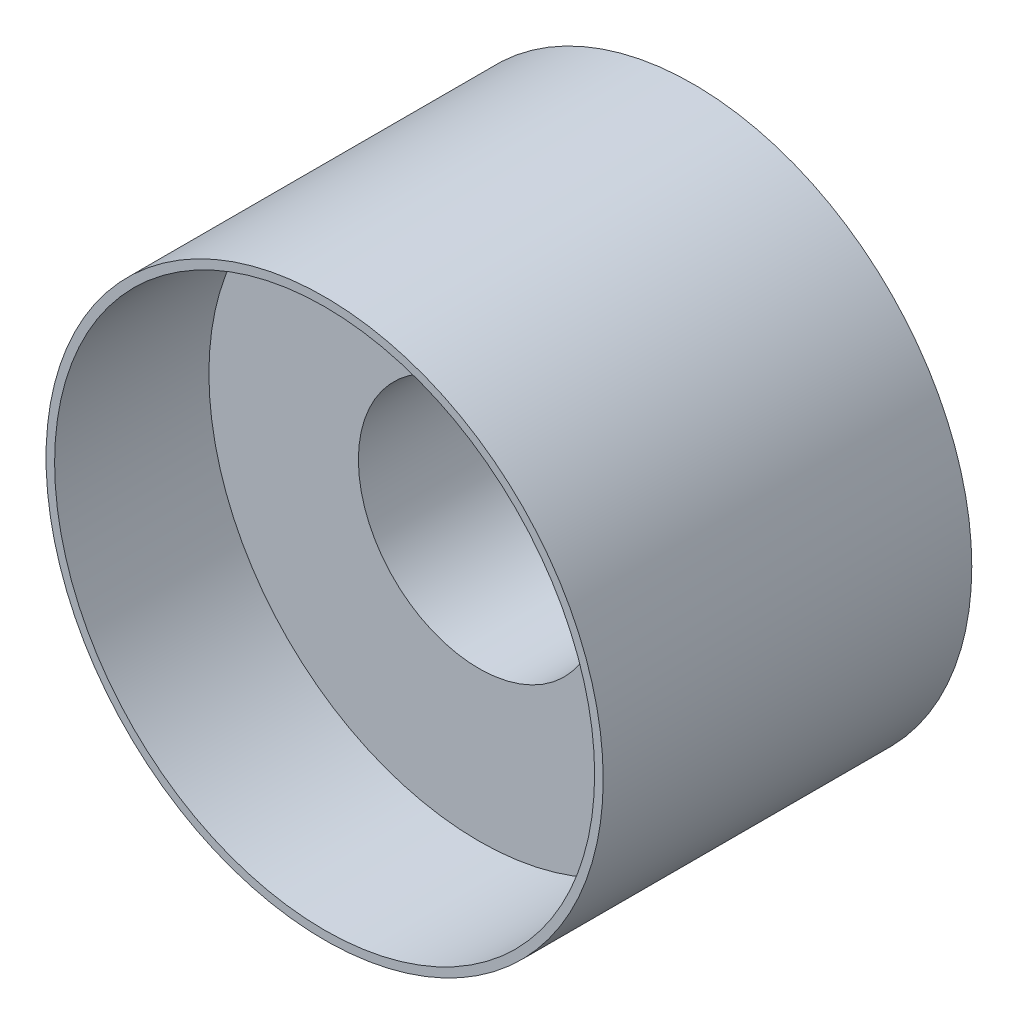
ISO-10303-21;
HEADER;
FILE_DESCRIPTION(('STEP AP214'),'2;1');
FILE_NAME('part.step','',(''),(''),'','','');
FILE_SCHEMA(('AUTOMOTIVE_DESIGN { 1 0 10303 214 1 1 1 1 }'));
ENDSEC;
DATA;
#1=APPLICATION_CONTEXT('core data for automotive mechanical design processes');
#2=APPLICATION_PROTOCOL_DEFINITION('international standard','automotive_design',2000,#1);
#3=PRODUCT_CONTEXT('',#1,'mechanical');
#4=PRODUCT('Part','Part','',(#3));
#5=PRODUCT_RELATED_PRODUCT_CATEGORY('part','',(#4));
#6=PRODUCT_DEFINITION_FORMATION('','',#4);
#7=PRODUCT_DEFINITION_CONTEXT('part definition',#1,'design');
#8=PRODUCT_DEFINITION('design','',#6,#7);
#9=PRODUCT_DEFINITION_SHAPE('','',#8);
#10=(LENGTH_UNIT() NAMED_UNIT(*) SI_UNIT(.MILLI.,.METRE.));
#11=(NAMED_UNIT(*) PLANE_ANGLE_UNIT() SI_UNIT($,.RADIAN.));
#12=(NAMED_UNIT(*) SI_UNIT($,.STERADIAN.) SOLID_ANGLE_UNIT());
#13=UNCERTAINTY_MEASURE_WITH_UNIT(LENGTH_MEASURE(1.E-05),#10,'distance_accuracy_value','');
#14=(GEOMETRIC_REPRESENTATION_CONTEXT(3) GLOBAL_UNCERTAINTY_ASSIGNED_CONTEXT((#13)) GLOBAL_UNIT_ASSIGNED_CONTEXT((#10,
#11,#12)) REPRESENTATION_CONTEXT('',''));
#15=CARTESIAN_POINT('',(0.,0.,0.));
#16=DIRECTION('',(0.,0.,1.));
#17=DIRECTION('',(1.,0.,0.));
#18=AXIS2_PLACEMENT_3D('',#15,#16,#17);
#19=CARTESIAN_POINT('',(0.,0.,-8.7376));
#20=DIRECTION('',(0.,0.,1.));
#21=DIRECTION('',(1.,0.,0.));
#22=AXIS2_PLACEMENT_3D('',#19,#20,#21);
#23=CYLINDRICAL_SURFACE('',#22,6.4008);
#24=CARTESIAN_POINT('',(0.,0.,0.));
#25=DIRECTION('',(0.,0.,1.));
#26=DIRECTION('',(1.,0.,0.));
#27=AXIS2_PLACEMENT_3D('',#24,#25,#26);
#28=CIRCLE('',#27,6.4008);
#29=CARTESIAN_POINT('',(6.4008,0.,0.));
#30=VERTEX_POINT('',#29);
#31=EDGE_CURVE('E49',#30,#30,#28,.T.);
#32=ORIENTED_EDGE('',*,*,#31,.T.);
#33=EDGE_LOOP('',(#32));
#34=FACE_BOUND('',#33,.T.);
#35=CARTESIAN_POINT('',(0.,0.,-3.6576));
#36=DIRECTION('',(0.,0.,-1.));
#37=DIRECTION('',(-1.,0.,0.));
#38=AXIS2_PLACEMENT_3D('',#35,#36,#37);
#39=CIRCLE('',#38,6.4008);
#40=CARTESIAN_POINT('',(-6.4008,0.,-3.6576));
#41=VERTEX_POINT('',#40);
#42=EDGE_CURVE('E10',#41,#41,#39,.F.);
#43=ORIENTED_EDGE('',*,*,#42,.F.);
#44=EDGE_LOOP('',(#43));
#45=FACE_BOUND('',#44,.T.);
#46=ADVANCED_FACE('F33',(#34,#45),#23,.F.);
#47=CARTESIAN_POINT('',(0.,0.,-8.7376));
#48=DIRECTION('',(0.,0.,1.));
#49=DIRECTION('',(1.,0.,0.));
#50=AXIS2_PLACEMENT_3D('',#47,#48,#49);
#51=CYLINDRICAL_SURFACE('',#50,6.604);
#52=CARTESIAN_POINT('',(0.,0.,-8.7376));
#53=DIRECTION('',(0.,0.,1.));
#54=DIRECTION('',(1.,0.,0.));
#55=AXIS2_PLACEMENT_3D('',#52,#53,#54);
#56=CIRCLE('',#55,6.604);
#57=CARTESIAN_POINT('',(6.604,0.,-8.7376));
#58=VERTEX_POINT('',#57);
#59=EDGE_CURVE('E40',#58,#58,#56,.T.);
#60=ORIENTED_EDGE('',*,*,#59,.T.);
#61=EDGE_LOOP('',(#60));
#62=FACE_BOUND('',#61,.T.);
#63=CARTESIAN_POINT('',(0.,0.,0.));
#64=DIRECTION('',(0.,0.,1.));
#65=DIRECTION('',(1.,0.,0.));
#66=AXIS2_PLACEMENT_3D('',#63,#64,#65);
#67=CIRCLE('',#66,6.604);
#68=CARTESIAN_POINT('',(6.604,0.,0.));
#69=VERTEX_POINT('',#68);
#70=EDGE_CURVE('E44',#69,#69,#67,.T.);
#71=ORIENTED_EDGE('',*,*,#70,.F.);
#72=EDGE_LOOP('',(#71));
#73=FACE_BOUND('',#72,.T.);
#74=ADVANCED_FACE('F35',(#62,#73),#51,.T.);
#75=CARTESIAN_POINT('',(0.,0.,-8.7376));
#76=DIRECTION('',(0.,0.,1.));
#77=DIRECTION('',(1.,0.,0.));
#78=AXIS2_PLACEMENT_3D('',#75,#76,#77);
#79=PLANE('',#78);
#80=ORIENTED_EDGE('',*,*,#59,.F.);
#81=EDGE_LOOP('',(#80));
#82=FACE_BOUND('',#81,.T.);
#83=CARTESIAN_POINT('',(0.,0.,-8.7376));
#84=DIRECTION('',(0.,0.,-1.));
#85=DIRECTION('',(-1.,0.,0.));
#86=AXIS2_PLACEMENT_3D('',#83,#84,#85);
#87=CIRCLE('',#86,2.8575);
#88=CARTESIAN_POINT('',(-2.8575,0.,-8.7376));
#89=VERTEX_POINT('',#88);
#90=EDGE_CURVE('E54',#89,#89,#87,.T.);
#91=ORIENTED_EDGE('',*,*,#90,.F.);
#92=EDGE_LOOP('',(#91));
#93=FACE_BOUND('',#92,.T.);
#94=ADVANCED_FACE('F68',(#82,#93),#79,.F.);
#95=CARTESIAN_POINT('',(0.,0.,0.));
#96=DIRECTION('',(0.,0.,1.));
#97=DIRECTION('',(1.,0.,0.));
#98=AXIS2_PLACEMENT_3D('',#95,#96,#97);
#99=PLANE('',#98);
#100=ORIENTED_EDGE('',*,*,#31,.F.);
#101=EDGE_LOOP('',(#100));
#102=FACE_BOUND('',#101,.T.);
#103=ORIENTED_EDGE('',*,*,#70,.T.);
#104=EDGE_LOOP('',(#103));
#105=FACE_BOUND('',#104,.T.);
#106=ADVANCED_FACE('F70',(#102,#105),#99,.T.);
#107=CARTESIAN_POINT('',(0.,0.,-3.6576));
#108=DIRECTION('',(0.,0.,-1.));
#109=DIRECTION('',(-1.,0.,0.));
#110=AXIS2_PLACEMENT_3D('',#107,#108,#109);
#111=PLANE('',#110);
#112=CARTESIAN_POINT('',(0.,0.,-3.6576));
#113=DIRECTION('',(0.,0.,-1.));
#114=DIRECTION('',(-1.,0.,0.));
#115=AXIS2_PLACEMENT_3D('',#112,#113,#114);
#116=CIRCLE('',#115,2.8575);
#117=CARTESIAN_POINT('',(-2.8575,0.,-3.6576));
#118=VERTEX_POINT('',#117);
#119=EDGE_CURVE('E53',#118,#118,#116,.T.);
#120=ORIENTED_EDGE('',*,*,#119,.T.);
#121=EDGE_LOOP('',(#120));
#122=FACE_BOUND('',#121,.T.);
#123=ORIENTED_EDGE('',*,*,#42,.T.);
#124=EDGE_LOOP('',(#123));
#125=FACE_BOUND('',#124,.T.);
#126=ADVANCED_FACE('F60',(#122,#125),#111,.F.);
#127=CARTESIAN_POINT('',(0.,0.,-3.6576));
#128=DIRECTION('',(0.,0.,-1.));
#129=DIRECTION('',(-1.,0.,0.));
#130=AXIS2_PLACEMENT_3D('',#127,#128,#129);
#131=CYLINDRICAL_SURFACE('',#130,2.8575);
#132=ORIENTED_EDGE('',*,*,#119,.F.);
#133=EDGE_LOOP('',(#132));
#134=FACE_BOUND('',#133,.T.);
#135=ORIENTED_EDGE('',*,*,#90,.T.);
#136=EDGE_LOOP('',(#135));
#137=FACE_BOUND('',#136,.T.);
#138=ADVANCED_FACE('F62',(#134,#137),#131,.F.);
#139=CLOSED_SHELL('',(#46,#74,#94,#106,#126,#138));
#140=MANIFOLD_SOLID_BREP('B2',#139);
#141=ADVANCED_BREP_SHAPE_REPRESENTATION('',(#18,#140),#14);
#142=SHAPE_DEFINITION_REPRESENTATION(#9,#141);
ENDSEC;
END-ISO-10303-21;
